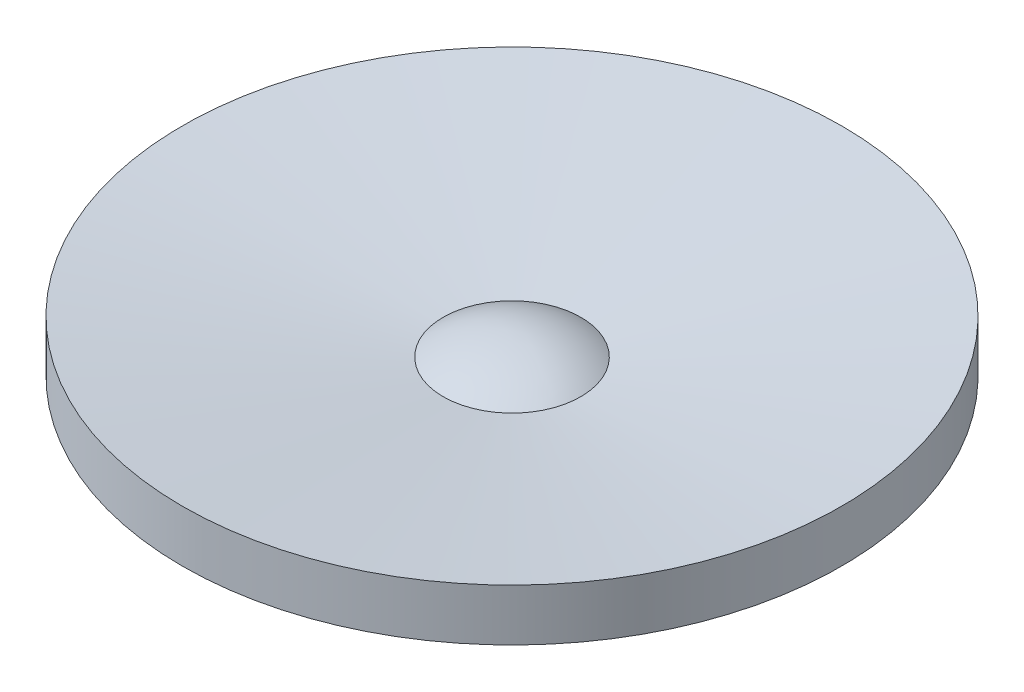
ISO-10303-21;
HEADER;
FILE_DESCRIPTION(('STEP AP214'),'2;1');
FILE_NAME('part.step','',(''),(''),'','','');
FILE_SCHEMA(('AUTOMOTIVE_DESIGN { 1 0 10303 214 1 1 1 1 }'));
ENDSEC;
DATA;
#1=APPLICATION_CONTEXT('core data for automotive mechanical design processes');
#2=APPLICATION_PROTOCOL_DEFINITION('international standard','automotive_design',2000,#1);
#3=PRODUCT_CONTEXT('',#1,'mechanical');
#4=PRODUCT('Part','Part','',(#3));
#5=PRODUCT_RELATED_PRODUCT_CATEGORY('part','',(#4));
#6=PRODUCT_DEFINITION_FORMATION('','',#4);
#7=PRODUCT_DEFINITION_CONTEXT('part definition',#1,'design');
#8=PRODUCT_DEFINITION('design','',#6,#7);
#9=PRODUCT_DEFINITION_SHAPE('','',#8);
#10=(LENGTH_UNIT() NAMED_UNIT(*) SI_UNIT(.MILLI.,.METRE.));
#11=(NAMED_UNIT(*) PLANE_ANGLE_UNIT() SI_UNIT($,.RADIAN.));
#12=(NAMED_UNIT(*) SI_UNIT($,.STERADIAN.) SOLID_ANGLE_UNIT());
#13=UNCERTAINTY_MEASURE_WITH_UNIT(LENGTH_MEASURE(1.E-05),#10,'distance_accuracy_value','');
#14=(GEOMETRIC_REPRESENTATION_CONTEXT(3) GLOBAL_UNCERTAINTY_ASSIGNED_CONTEXT((#13)) GLOBAL_UNIT_ASSIGNED_CONTEXT((#10,
#11,#12)) REPRESENTATION_CONTEXT('',''));
#15=CARTESIAN_POINT('',(0.,0.,0.));
#16=DIRECTION('',(0.,0.,1.));
#17=DIRECTION('',(1.,0.,0.));
#18=AXIS2_PLACEMENT_3D('',#15,#16,#17);
#19=CARTESIAN_POINT('',(0.,-1.07068605140429,0.));
#20=DIRECTION('',(1.,0.,0.));
#21=DIRECTION('',(0.,0.,-1.));
#22=AXIS2_PLACEMENT_3D('',#19,#20,#21);
#23=SPHERICAL_SURFACE('',#22,1.52036774980897);
#24=CARTESIAN_POINT('',(0.,0.199681698389219,0.));
#25=DIRECTION('',(0.,1.,0.));
#26=DIRECTION('',(0.,0.,1.));
#27=AXIS2_PLACEMENT_3D('',#24,#25,#26);
#28=CIRCLE('',#27,0.835274730206947);
#29=CARTESIAN_POINT('',(0.,0.199681698389219,0.835274730206947));
#30=VERTEX_POINT('',#29);
#31=EDGE_CURVE('E19',#30,#30,#28,.T.);
#32=ORIENTED_EDGE('',*,*,#31,.T.);
#33=EDGE_LOOP('',(#32));
#34=FACE_BOUND('',#33,.T.);
#35=ADVANCED_FACE('F15',(#34),#23,.T.);
#36=CARTESIAN_POINT('',(0.,0.629909459064493,0.));
#37=DIRECTION('',(0.,1.,0.));
#38=DIRECTION('',(0.,0.,1.));
#39=AXIS2_PLACEMENT_3D('',#36,#37,#38);
#40=CONICAL_SURFACE('',#39,3.99999999996226,1.43567988293765);
#41=ORIENTED_EDGE('',*,*,#31,.F.);
#42=EDGE_LOOP('',(#41));
#43=FACE_BOUND('',#42,.T.);
#44=CARTESIAN_POINT('',(0.,0.629909459085063,0.));
#45=DIRECTION('',(0.,1.,0.));
#46=DIRECTION('',(0.,0.,1.));
#47=AXIS2_PLACEMENT_3D('',#44,#45,#46);
#48=CIRCLE('',#47,4.);
#49=CARTESIAN_POINT('',(0.,0.629909459085063,4.));
#50=VERTEX_POINT('',#49);
#51=EDGE_CURVE('E23',#50,#50,#48,.F.);
#52=ORIENTED_EDGE('',*,*,#51,.F.);
#53=EDGE_LOOP('',(#52));
#54=FACE_BOUND('',#53,.T.);
#55=ADVANCED_FACE('F35',(#43,#54),#40,.F.);
#56=CARTESIAN_POINT('',(0.,1.28172227025504,0.));
#57=DIRECTION('',(0.,1.,0.));
#58=DIRECTION('',(0.,0.,1.));
#59=AXIS2_PLACEMENT_3D('',#56,#57,#58);
#60=CYLINDRICAL_SURFACE('',#59,4.);
#61=ORIENTED_EDGE('',*,*,#51,.T.);
#62=EDGE_LOOP('',(#61));
#63=FACE_BOUND('',#62,.T.);
#64=CARTESIAN_POINT('',(0.,0.,0.));
#65=DIRECTION('',(0.,1.,0.));
#66=DIRECTION('',(0.,0.,1.));
#67=AXIS2_PLACEMENT_3D('',#64,#65,#66);
#68=CIRCLE('',#67,4.);
#69=CARTESIAN_POINT('',(0.,0.,4.));
#70=VERTEX_POINT('',#69);
#71=EDGE_CURVE('E10',#70,#70,#68,.T.);
#72=ORIENTED_EDGE('',*,*,#71,.T.);
#73=EDGE_LOOP('',(#72));
#74=FACE_BOUND('',#73,.T.);
#75=ADVANCED_FACE('F38',(#63,#74),#60,.T.);
#76=CARTESIAN_POINT('',(0.,0.,0.));
#77=DIRECTION('',(0.,1.,0.));
#78=DIRECTION('',(0.,0.,1.));
#79=AXIS2_PLACEMENT_3D('',#76,#77,#78);
#80=PLANE('',#79);
#81=ORIENTED_EDGE('',*,*,#71,.F.);
#82=EDGE_LOOP('',(#81));
#83=FACE_BOUND('',#82,.T.);
#84=ADVANCED_FACE('F44',(#83),#80,.F.);
#85=CLOSED_SHELL('',(#35,#55,#75,#84));
#86=MANIFOLD_SOLID_BREP('B1',#85);
#87=ADVANCED_BREP_SHAPE_REPRESENTATION('',(#18,#86),#14);
#88=SHAPE_DEFINITION_REPRESENTATION(#9,#87);
ENDSEC;
END-ISO-10303-21;
